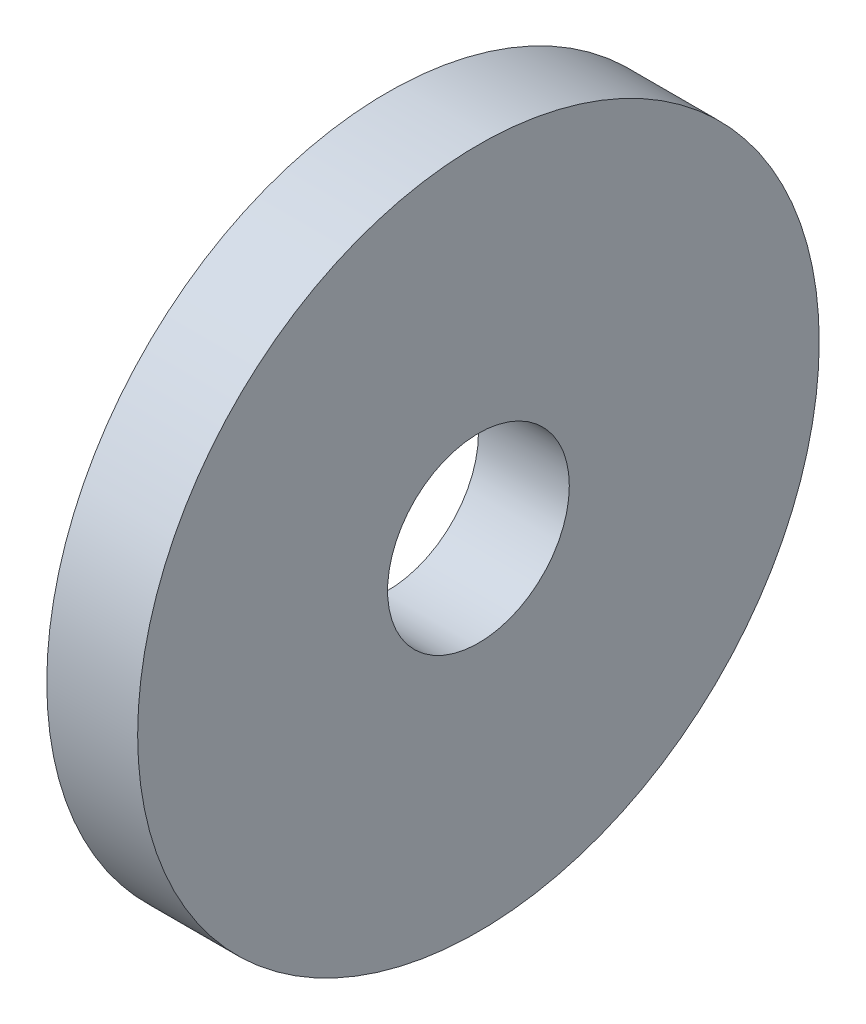
ISO-10303-21;
HEADER;
FILE_DESCRIPTION(('STEP AP214'),'2;1');
FILE_NAME('part.step','',(''),(''),'','','');
FILE_SCHEMA(('AUTOMOTIVE_DESIGN { 1 0 10303 214 1 1 1 1 }'));
ENDSEC;
DATA;
#1=APPLICATION_CONTEXT('core data for automotive mechanical design processes');
#2=APPLICATION_PROTOCOL_DEFINITION('international standard','automotive_design',2000,#1);
#3=PRODUCT_CONTEXT('',#1,'mechanical');
#4=PRODUCT('Part','Part','',(#3));
#5=PRODUCT_RELATED_PRODUCT_CATEGORY('part','',(#4));
#6=PRODUCT_DEFINITION_FORMATION('','',#4);
#7=PRODUCT_DEFINITION_CONTEXT('part definition',#1,'design');
#8=PRODUCT_DEFINITION('design','',#6,#7);
#9=PRODUCT_DEFINITION_SHAPE('','',#8);
#10=(LENGTH_UNIT() NAMED_UNIT(*) SI_UNIT(.MILLI.,.METRE.));
#11=(NAMED_UNIT(*) PLANE_ANGLE_UNIT() SI_UNIT($,.RADIAN.));
#12=(NAMED_UNIT(*) SI_UNIT($,.STERADIAN.) SOLID_ANGLE_UNIT());
#13=UNCERTAINTY_MEASURE_WITH_UNIT(LENGTH_MEASURE(1.E-05),#10,'distance_accuracy_value','');
#14=(GEOMETRIC_REPRESENTATION_CONTEXT(3) GLOBAL_UNCERTAINTY_ASSIGNED_CONTEXT((#13)) GLOBAL_UNIT_ASSIGNED_CONTEXT((#10,
#11,#12)) REPRESENTATION_CONTEXT('',''));
#15=CARTESIAN_POINT('',(0.,0.,0.));
#16=DIRECTION('',(0.,0.,1.));
#17=DIRECTION('',(1.,0.,0.));
#18=AXIS2_PLACEMENT_3D('',#15,#16,#17);
#19=CARTESIAN_POINT('',(10.,0.,0.));
#20=DIRECTION('',(-1.,0.,0.));
#21=DIRECTION('',(0.,0.,1.));
#22=AXIS2_PLACEMENT_3D('',#19,#20,#21);
#23=CYLINDRICAL_SURFACE('',#22,37.5);
#24=CARTESIAN_POINT('',(10.,0.,0.));
#25=DIRECTION('',(1.,0.,0.));
#26=DIRECTION('',(0.,0.,-1.));
#27=AXIS2_PLACEMENT_3D('',#24,#25,#26);
#28=CIRCLE('',#27,37.5);
#29=CARTESIAN_POINT('',(10.,0.,-37.5));
#30=VERTEX_POINT('',#29);
#31=EDGE_CURVE('E10',#30,#30,#28,.T.);
#32=ORIENTED_EDGE('',*,*,#31,.F.);
#33=EDGE_LOOP('',(#32));
#34=FACE_BOUND('',#33,.T.);
#35=CARTESIAN_POINT('',(0.,0.,0.));
#36=DIRECTION('',(1.,0.,0.));
#37=DIRECTION('',(0.,0.,-1.));
#38=AXIS2_PLACEMENT_3D('',#35,#36,#37);
#39=CIRCLE('',#38,37.5);
#40=CARTESIAN_POINT('',(0.,0.,-37.5));
#41=VERTEX_POINT('',#40);
#42=EDGE_CURVE('E43',#41,#41,#39,.T.);
#43=ORIENTED_EDGE('',*,*,#42,.T.);
#44=EDGE_LOOP('',(#43));
#45=FACE_BOUND('',#44,.T.);
#46=ADVANCED_FACE('F40',(#34,#45),#23,.T.);
#47=CARTESIAN_POINT('',(10.,0.,0.));
#48=DIRECTION('',(1.,0.,0.));
#49=DIRECTION('',(0.,0.,-1.));
#50=AXIS2_PLACEMENT_3D('',#47,#48,#49);
#51=PLANE('',#50);
#52=CARTESIAN_POINT('',(10.,0.,0.));
#53=DIRECTION('',(1.,0.,0.));
#54=DIRECTION('',(0.,0.,-1.));
#55=AXIS2_PLACEMENT_3D('',#52,#53,#54);
#56=CIRCLE('',#55,10.);
#57=CARTESIAN_POINT('',(10.,0.,-10.));
#58=VERTEX_POINT('',#57);
#59=EDGE_CURVE('E54',#58,#58,#56,.T.);
#60=ORIENTED_EDGE('',*,*,#59,.F.);
#61=EDGE_LOOP('',(#60));
#62=FACE_BOUND('',#61,.T.);
#63=ORIENTED_EDGE('',*,*,#31,.T.);
#64=EDGE_LOOP('',(#63));
#65=FACE_BOUND('',#64,.T.);
#66=ADVANCED_FACE('F71',(#62,#65),#51,.T.);
#67=CARTESIAN_POINT('',(0.,0.,0.));
#68=DIRECTION('',(1.,0.,0.));
#69=DIRECTION('',(0.,0.,-1.));
#70=AXIS2_PLACEMENT_3D('',#67,#68,#69);
#71=PLANE('',#70);
#72=CARTESIAN_POINT('',(0.,0.,0.));
#73=DIRECTION('',(1.,0.,0.));
#74=DIRECTION('',(0.,0.,-1.));
#75=AXIS2_PLACEMENT_3D('',#72,#73,#74);
#76=CIRCLE('',#75,10.);
#77=CARTESIAN_POINT('',(0.,0.,-10.));
#78=VERTEX_POINT('',#77);
#79=EDGE_CURVE('E52',#78,#78,#76,.T.);
#80=ORIENTED_EDGE('',*,*,#79,.T.);
#81=EDGE_LOOP('',(#80));
#82=FACE_BOUND('',#81,.T.);
#83=ORIENTED_EDGE('',*,*,#42,.F.);
#84=EDGE_LOOP('',(#83));
#85=FACE_BOUND('',#84,.T.);
#86=ADVANCED_FACE('F62',(#82,#85),#71,.F.);
#87=CARTESIAN_POINT('',(0.,0.,0.));
#88=DIRECTION('',(1.,0.,0.));
#89=DIRECTION('',(0.,0.,-1.));
#90=AXIS2_PLACEMENT_3D('',#87,#88,#89);
#91=CYLINDRICAL_SURFACE('',#90,10.);
#92=ORIENTED_EDGE('',*,*,#79,.F.);
#93=EDGE_LOOP('',(#92));
#94=FACE_BOUND('',#93,.T.);
#95=ORIENTED_EDGE('',*,*,#59,.T.);
#96=EDGE_LOOP('',(#95));
#97=FACE_BOUND('',#96,.T.);
#98=ADVANCED_FACE('F65',(#94,#97),#91,.F.);
#99=CLOSED_SHELL('',(#46,#66,#86,#98));
#100=MANIFOLD_SOLID_BREP('B2',#99);
#101=ADVANCED_BREP_SHAPE_REPRESENTATION('',(#18,#100),#14);
#102=SHAPE_DEFINITION_REPRESENTATION(#9,#101);
ENDSEC;
END-ISO-10303-21;
